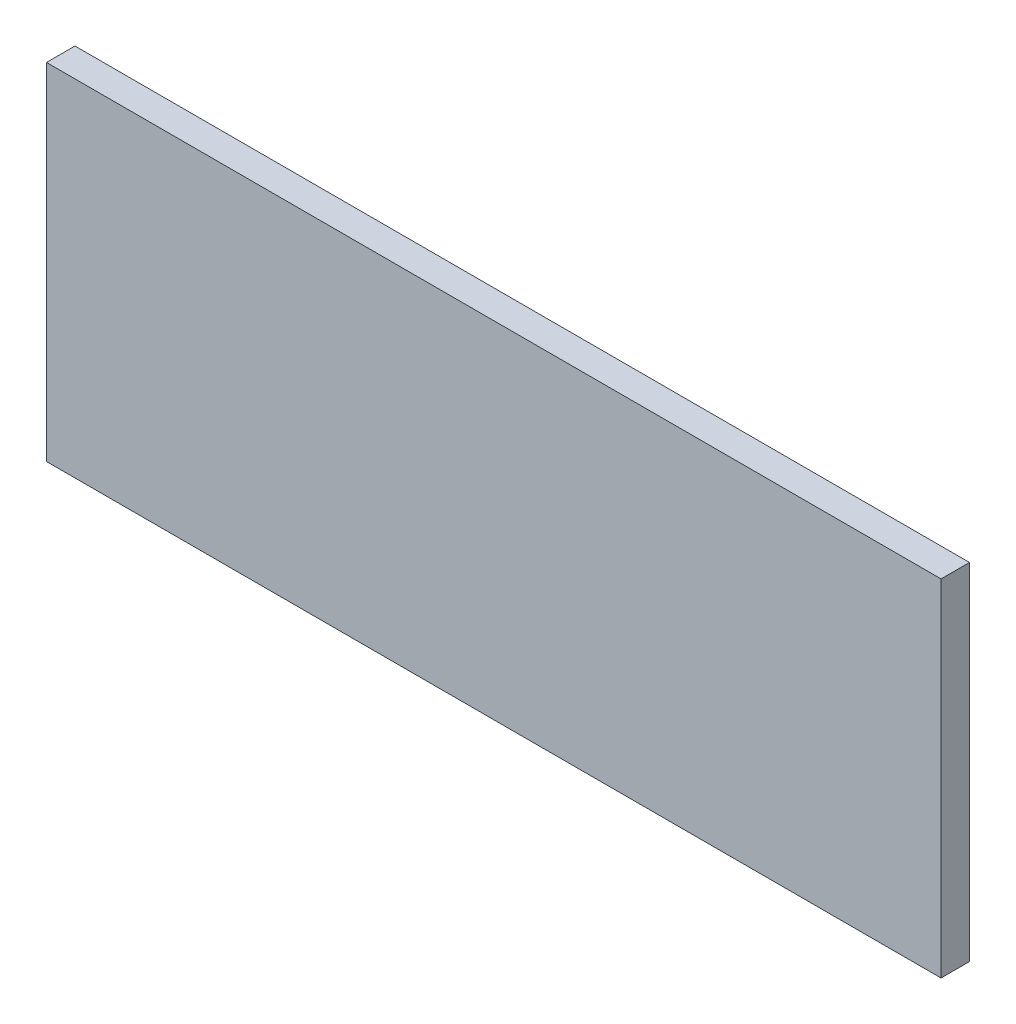
ISO-10303-21;
HEADER;
FILE_DESCRIPTION(('STEP AP214'),'2;1');
FILE_NAME('part.step','',(''),(''),'','','');
FILE_SCHEMA(('AUTOMOTIVE_DESIGN { 1 0 10303 214 1 1 1 1 }'));
ENDSEC;
DATA;
#1=APPLICATION_CONTEXT('core data for automotive mechanical design processes');
#2=APPLICATION_PROTOCOL_DEFINITION('international standard','automotive_design',2000,#1);
#3=PRODUCT_CONTEXT('',#1,'mechanical');
#4=PRODUCT('Part','Part','',(#3));
#5=PRODUCT_RELATED_PRODUCT_CATEGORY('part','',(#4));
#6=PRODUCT_DEFINITION_FORMATION('','',#4);
#7=PRODUCT_DEFINITION_CONTEXT('part definition',#1,'design');
#8=PRODUCT_DEFINITION('design','',#6,#7);
#9=PRODUCT_DEFINITION_SHAPE('','',#8);
#10=(LENGTH_UNIT() NAMED_UNIT(*) SI_UNIT(.MILLI.,.METRE.));
#11=(NAMED_UNIT(*) PLANE_ANGLE_UNIT() SI_UNIT($,.RADIAN.));
#12=(NAMED_UNIT(*) SI_UNIT($,.STERADIAN.) SOLID_ANGLE_UNIT());
#13=UNCERTAINTY_MEASURE_WITH_UNIT(LENGTH_MEASURE(1.E-05),#10,'distance_accuracy_value','');
#14=(GEOMETRIC_REPRESENTATION_CONTEXT(3) GLOBAL_UNCERTAINTY_ASSIGNED_CONTEXT((#13)) GLOBAL_UNIT_ASSIGNED_CONTEXT((#10,
#11,#12)) REPRESENTATION_CONTEXT('',''));
#15=CARTESIAN_POINT('',(0.,0.,0.));
#16=DIRECTION('',(0.,0.,1.));
#17=DIRECTION('',(1.,0.,0.));
#18=AXIS2_PLACEMENT_3D('',#15,#16,#17);
#19=CARTESIAN_POINT('',(44.,-17.,2.8));
#20=DIRECTION('',(-1.,0.,0.));
#21=DIRECTION('',(0.,0.,1.));
#22=AXIS2_PLACEMENT_3D('',#19,#20,#21);
#23=PLANE('',#22);
#24=DIRECTION('',(0.,1.,0.));
#25=VECTOR('',#24,1.);
#26=CARTESIAN_POINT('',(44.,-17.,0.));
#27=LINE('',#26,#25);
#28=CARTESIAN_POINT('',(44.,-17.,0.));
#29=VERTEX_POINT('',#28);
#30=CARTESIAN_POINT('',(44.,17.,0.));
#31=VERTEX_POINT('',#30);
#32=EDGE_CURVE('E100',#29,#31,#27,.T.);
#33=ORIENTED_EDGE('',*,*,#32,.T.);
#34=DIRECTION('',(0.,0.,-1.));
#35=VECTOR('',#34,1.);
#36=CARTESIAN_POINT('',(44.,17.,2.8));
#37=LINE('',#36,#35);
#38=CARTESIAN_POINT('',(44.,17.,2.8));
#39=VERTEX_POINT('',#38);
#40=EDGE_CURVE('E11',#39,#31,#37,.T.);
#41=ORIENTED_EDGE('',*,*,#40,.F.);
#42=DIRECTION('',(0.,1.,0.));
#43=VECTOR('',#42,1.);
#44=CARTESIAN_POINT('',(44.,-17.,2.8));
#45=LINE('',#44,#43);
#46=CARTESIAN_POINT('',(44.,-17.,2.8));
#47=VERTEX_POINT('',#46);
#48=EDGE_CURVE('E88',#47,#39,#45,.T.);
#49=ORIENTED_EDGE('',*,*,#48,.F.);
#50=DIRECTION('',(0.,0.,-1.));
#51=VECTOR('',#50,1.);
#52=CARTESIAN_POINT('',(44.,-17.,2.8));
#53=LINE('',#52,#51);
#54=EDGE_CURVE('E96',#47,#29,#53,.T.);
#55=ORIENTED_EDGE('',*,*,#54,.T.);
#56=EDGE_LOOP('',(#33,#41,#49,#55));
#57=FACE_BOUND('',#56,.T.);
#58=ADVANCED_FACE('F37',(#57),#23,.F.);
#59=CARTESIAN_POINT('',(-44.,17.,2.8));
#60=DIRECTION('',(0.,-1.,0.));
#61=DIRECTION('',(0.,0.,-1.));
#62=AXIS2_PLACEMENT_3D('',#59,#60,#61);
#63=PLANE('',#62);
#64=DIRECTION('',(-1.,0.,0.));
#65=VECTOR('',#64,1.);
#66=CARTESIAN_POINT('',(-44.,17.,0.));
#67=LINE('',#66,#65);
#68=CARTESIAN_POINT('',(-44.,17.,0.));
#69=VERTEX_POINT('',#68);
#70=EDGE_CURVE('E92',#31,#69,#67,.T.);
#71=ORIENTED_EDGE('',*,*,#70,.T.);
#72=DIRECTION('',(0.,0.,-1.));
#73=VECTOR('',#72,1.);
#74=CARTESIAN_POINT('',(-44.,17.,2.8));
#75=LINE('',#74,#73);
#76=CARTESIAN_POINT('',(-44.,17.,2.8));
#77=VERTEX_POINT('',#76);
#78=EDGE_CURVE('E45',#77,#69,#75,.T.);
#79=ORIENTED_EDGE('',*,*,#78,.F.);
#80=DIRECTION('',(-1.,0.,0.));
#81=VECTOR('',#80,1.);
#82=CARTESIAN_POINT('',(-44.,17.,2.8));
#83=LINE('',#82,#81);
#84=EDGE_CURVE('E83',#39,#77,#83,.T.);
#85=ORIENTED_EDGE('',*,*,#84,.F.);
#86=ORIENTED_EDGE('',*,*,#40,.T.);
#87=EDGE_LOOP('',(#71,#79,#85,#86));
#88=FACE_BOUND('',#87,.T.);
#89=ADVANCED_FACE('F91',(#88),#63,.F.);
#90=CARTESIAN_POINT('',(-44.,-17.,2.8));
#91=DIRECTION('',(1.,0.,0.));
#92=DIRECTION('',(0.,0.,-1.));
#93=AXIS2_PLACEMENT_3D('',#90,#91,#92);
#94=PLANE('',#93);
#95=DIRECTION('',(0.,-1.,0.));
#96=VECTOR('',#95,1.);
#97=CARTESIAN_POINT('',(-44.,-17.,0.));
#98=LINE('',#97,#96);
#99=CARTESIAN_POINT('',(-44.,-17.,0.));
#100=VERTEX_POINT('',#99);
#101=EDGE_CURVE('E70',#69,#100,#98,.T.);
#102=ORIENTED_EDGE('',*,*,#101,.T.);
#103=DIRECTION('',(0.,0.,-1.));
#104=VECTOR('',#103,1.);
#105=CARTESIAN_POINT('',(-44.,-17.,2.8));
#106=LINE('',#105,#104);
#107=CARTESIAN_POINT('',(-44.,-17.,2.8));
#108=VERTEX_POINT('',#107);
#109=EDGE_CURVE('E93',#108,#100,#106,.T.);
#110=ORIENTED_EDGE('',*,*,#109,.F.);
#111=DIRECTION('',(0.,-1.,0.));
#112=VECTOR('',#111,1.);
#113=CARTESIAN_POINT('',(-44.,-17.,2.8));
#114=LINE('',#113,#112);
#115=EDGE_CURVE('E86',#77,#108,#114,.T.);
#116=ORIENTED_EDGE('',*,*,#115,.F.);
#117=ORIENTED_EDGE('',*,*,#78,.T.);
#118=EDGE_LOOP('',(#102,#110,#116,#117));
#119=FACE_BOUND('',#118,.T.);
#120=ADVANCED_FACE('F94',(#119),#94,.F.);
#121=CARTESIAN_POINT('',(-44.,-17.,2.8));
#122=DIRECTION('',(0.,1.,0.));
#123=DIRECTION('',(0.,0.,1.));
#124=AXIS2_PLACEMENT_3D('',#121,#122,#123);
#125=PLANE('',#124);
#126=DIRECTION('',(1.,0.,0.));
#127=VECTOR('',#126,1.);
#128=CARTESIAN_POINT('',(-44.,-17.,0.));
#129=LINE('',#128,#127);
#130=EDGE_CURVE('E76',#100,#29,#129,.T.);
#131=ORIENTED_EDGE('',*,*,#130,.T.);
#132=ORIENTED_EDGE('',*,*,#54,.F.);
#133=DIRECTION('',(1.,0.,0.));
#134=VECTOR('',#133,1.);
#135=CARTESIAN_POINT('',(-44.,-17.,2.8));
#136=LINE('',#135,#134);
#137=EDGE_CURVE('E53',#108,#47,#136,.T.);
#138=ORIENTED_EDGE('',*,*,#137,.F.);
#139=ORIENTED_EDGE('',*,*,#109,.T.);
#140=EDGE_LOOP('',(#131,#132,#138,#139));
#141=FACE_BOUND('',#140,.T.);
#142=ADVANCED_FACE('F107',(#141),#125,.F.);
#143=CARTESIAN_POINT('',(0.,0.,2.8));
#144=DIRECTION('',(0.,0.,-1.));
#145=DIRECTION('',(-1.,0.,0.));
#146=AXIS2_PLACEMENT_3D('',#143,#144,#145);
#147=PLANE('',#146);
#148=ORIENTED_EDGE('',*,*,#48,.T.);
#149=ORIENTED_EDGE('',*,*,#84,.T.);
#150=ORIENTED_EDGE('',*,*,#115,.T.);
#151=ORIENTED_EDGE('',*,*,#137,.T.);
#152=EDGE_LOOP('',(#148,#149,#150,#151));
#153=FACE_BOUND('',#152,.T.);
#154=ADVANCED_FACE('F84',(#153),#147,.F.);
#155=CARTESIAN_POINT('',(0.,0.,0.));
#156=DIRECTION('',(0.,0.,-1.));
#157=DIRECTION('',(-1.,0.,0.));
#158=AXIS2_PLACEMENT_3D('',#155,#156,#157);
#159=PLANE('',#158);
#160=ORIENTED_EDGE('',*,*,#32,.F.);
#161=ORIENTED_EDGE('',*,*,#130,.F.);
#162=ORIENTED_EDGE('',*,*,#101,.F.);
#163=ORIENTED_EDGE('',*,*,#70,.F.);
#164=EDGE_LOOP('',(#160,#161,#162,#163));
#165=FACE_BOUND('',#164,.T.);
#166=ADVANCED_FACE('F110',(#165),#159,.T.);
#167=CLOSED_SHELL('',(#58,#89,#120,#142,#154,#166));
#168=MANIFOLD_SOLID_BREP('B2',#167);
#169=ADVANCED_BREP_SHAPE_REPRESENTATION('',(#18,#168),#14);
#170=SHAPE_DEFINITION_REPRESENTATION(#9,#169);
ENDSEC;
END-ISO-10303-21;
